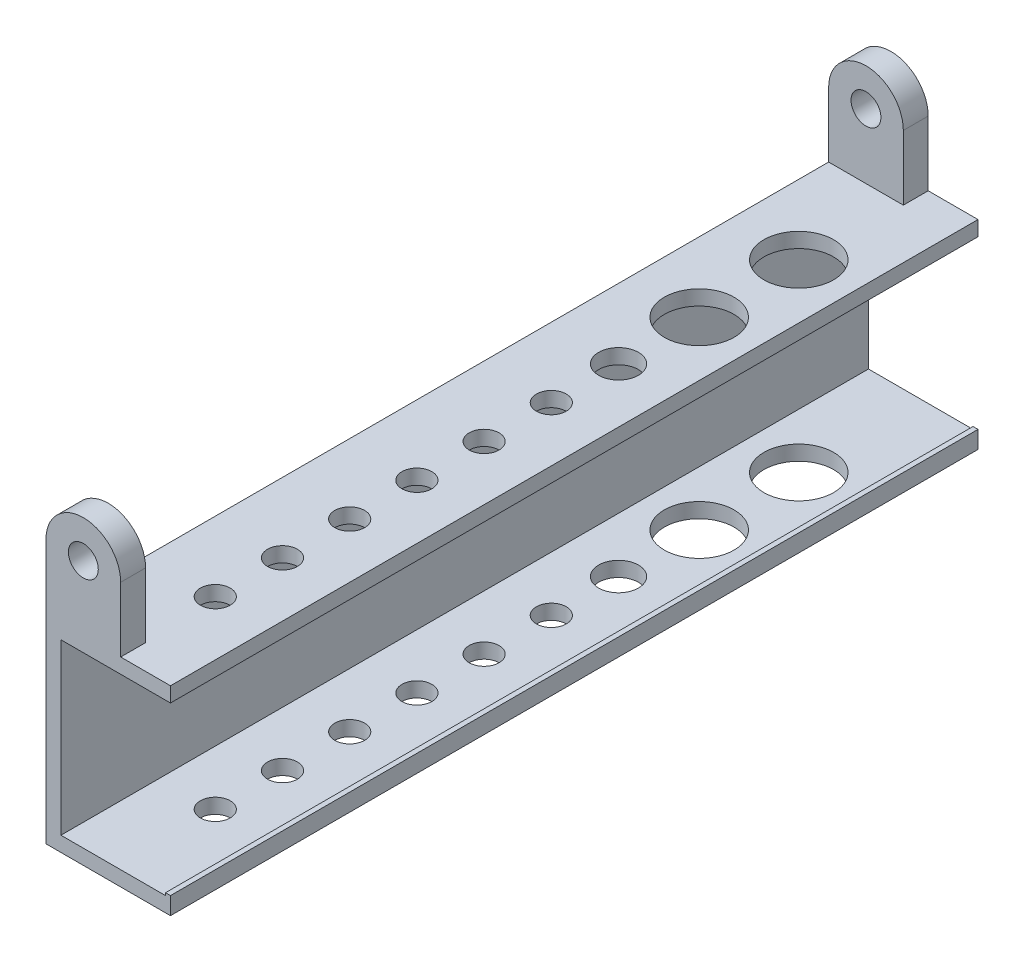
ISO-10303-21;
HEADER;
FILE_DESCRIPTION(('STEP AP214'),'2;1');
FILE_NAME('part.step','',(''),(''),'','','');
FILE_SCHEMA(('AUTOMOTIVE_DESIGN { 1 0 10303 214 1 1 1 1 }'));
ENDSEC;
DATA;
#1=APPLICATION_CONTEXT('core data for automotive mechanical design processes');
#2=APPLICATION_PROTOCOL_DEFINITION('international standard','automotive_design',2000,#1);
#3=PRODUCT_CONTEXT('',#1,'mechanical');
#4=PRODUCT('Part','Part','',(#3));
#5=PRODUCT_RELATED_PRODUCT_CATEGORY('part','',(#4));
#6=PRODUCT_DEFINITION_FORMATION('','',#4);
#7=PRODUCT_DEFINITION_CONTEXT('part definition',#1,'design');
#8=PRODUCT_DEFINITION('design','',#6,#7);
#9=PRODUCT_DEFINITION_SHAPE('','',#8);
#10=(LENGTH_UNIT() NAMED_UNIT(*) SI_UNIT(.MILLI.,.METRE.));
#11=(NAMED_UNIT(*) PLANE_ANGLE_UNIT() SI_UNIT($,.RADIAN.));
#12=(NAMED_UNIT(*) SI_UNIT($,.STERADIAN.) SOLID_ANGLE_UNIT());
#13=UNCERTAINTY_MEASURE_WITH_UNIT(LENGTH_MEASURE(1.E-05),#10,'distance_accuracy_value','');
#14=(GEOMETRIC_REPRESENTATION_CONTEXT(3) GLOBAL_UNCERTAINTY_ASSIGNED_CONTEXT((#13)) GLOBAL_UNIT_ASSIGNED_CONTEXT((#10,
#11,#12)) REPRESENTATION_CONTEXT('',''));
#15=CARTESIAN_POINT('',(0.,0.,0.));
#16=DIRECTION('',(0.,0.,1.));
#17=DIRECTION('',(1.,0.,0.));
#18=AXIS2_PLACEMENT_3D('',#15,#16,#17);
#19=CARTESIAN_POINT('',(25.,20.,162.2));
#20=DIRECTION('',(0.,-1.,0.));
#21=DIRECTION('',(1.,0.,0.));
#22=AXIS2_PLACEMENT_3D('',#19,#20,#21);
#23=PLANE('',#22);
#24=CARTESIAN_POINT('',(14.,20.,142.2));
#25=DIRECTION('',(0.,1.,0.));
#26=DIRECTION('',(-1.,0.,0.));
#27=AXIS2_PLACEMENT_3D('',#24,#25,#26);
#28=CIRCLE('',#27,3.);
#29=CARTESIAN_POINT('',(11.,20.,142.2));
#30=VERTEX_POINT('',#29);
#31=EDGE_CURVE('E716',#30,#30,#28,.T.);
#32=ORIENTED_EDGE('',*,*,#31,.F.);
#33=EDGE_LOOP('',(#32));
#34=FACE_BOUND('',#33,.T.);
#35=CARTESIAN_POINT('',(14.,20.,88.2));
#36=DIRECTION('',(0.,1.,0.));
#37=DIRECTION('',(-1.,0.,0.));
#38=AXIS2_PLACEMENT_3D('',#35,#36,#37);
#39=CIRCLE('',#38,3.);
#40=CARTESIAN_POINT('',(11.,20.,88.2));
#41=VERTEX_POINT('',#40);
#42=EDGE_CURVE('E803',#41,#41,#39,.T.);
#43=ORIENTED_EDGE('',*,*,#42,.F.);
#44=EDGE_LOOP('',(#43));
#45=FACE_BOUND('',#44,.T.);
#46=CARTESIAN_POINT('',(14.,20.,45.));
#47=DIRECTION('',(0.,1.,0.));
#48=DIRECTION('',(-1.,0.,0.));
#49=AXIS2_PLACEMENT_3D('',#46,#47,#48);
#50=CIRCLE('',#49,7.00000000000002);
#51=CARTESIAN_POINT('',(6.99999999999999,20.,45.));
#52=VERTEX_POINT('',#51);
#53=EDGE_CURVE('E796',#52,#52,#50,.T.);
#54=ORIENTED_EDGE('',*,*,#53,.F.);
#55=EDGE_LOOP('',(#54));
#56=FACE_BOUND('',#55,.T.);
#57=CARTESIAN_POINT('',(14.,20.,25.));
#58=DIRECTION('',(0.,1.,0.));
#59=DIRECTION('',(-1.,0.,0.));
#60=AXIS2_PLACEMENT_3D('',#57,#58,#59);
#61=CIRCLE('',#60,7.00000000000001);
#62=CARTESIAN_POINT('',(7.,20.,25.));
#63=VERTEX_POINT('',#62);
#64=EDGE_CURVE('E814',#63,#63,#61,.T.);
#65=ORIENTED_EDGE('',*,*,#64,.F.);
#66=EDGE_LOOP('',(#65));
#67=FACE_BOUND('',#66,.T.);
#68=CARTESIAN_POINT('',(14.,20.,61.2));
#69=DIRECTION('',(0.,1.,0.));
#70=DIRECTION('',(-1.,0.,0.));
#71=AXIS2_PLACEMENT_3D('',#68,#69,#70);
#72=CIRCLE('',#71,4.);
#73=CARTESIAN_POINT('',(10.,20.,61.2));
#74=VERTEX_POINT('',#73);
#75=EDGE_CURVE('E808',#74,#74,#72,.T.);
#76=ORIENTED_EDGE('',*,*,#75,.F.);
#77=EDGE_LOOP('',(#76));
#78=FACE_BOUND('',#77,.T.);
#79=CARTESIAN_POINT('',(14.,20.,74.7));
#80=DIRECTION('',(0.,1.,0.));
#81=DIRECTION('',(-1.,0.,0.));
#82=AXIS2_PLACEMENT_3D('',#79,#80,#81);
#83=CIRCLE('',#82,3.);
#84=CARTESIAN_POINT('',(11.,20.,74.7));
#85=VERTEX_POINT('',#84);
#86=EDGE_CURVE('E771',#85,#85,#83,.T.);
#87=ORIENTED_EDGE('',*,*,#86,.F.);
#88=EDGE_LOOP('',(#87));
#89=FACE_BOUND('',#88,.T.);
#90=CARTESIAN_POINT('',(14.,20.,101.7));
#91=DIRECTION('',(0.,1.,0.));
#92=DIRECTION('',(-1.,0.,0.));
#93=AXIS2_PLACEMENT_3D('',#90,#91,#92);
#94=CIRCLE('',#93,3.);
#95=CARTESIAN_POINT('',(11.,20.,101.7));
#96=VERTEX_POINT('',#95);
#97=EDGE_CURVE('E778',#96,#96,#94,.T.);
#98=ORIENTED_EDGE('',*,*,#97,.F.);
#99=EDGE_LOOP('',(#98));
#100=FACE_BOUND('',#99,.T.);
#101=CARTESIAN_POINT('',(14.,20.,115.2));
#102=DIRECTION('',(0.,1.,0.));
#103=DIRECTION('',(-1.,0.,0.));
#104=AXIS2_PLACEMENT_3D('',#101,#102,#103);
#105=CIRCLE('',#104,3.);
#106=CARTESIAN_POINT('',(11.,20.,115.2));
#107=VERTEX_POINT('',#106);
#108=EDGE_CURVE('E784',#107,#107,#105,.T.);
#109=ORIENTED_EDGE('',*,*,#108,.F.);
#110=EDGE_LOOP('',(#109));
#111=FACE_BOUND('',#110,.T.);
#112=CARTESIAN_POINT('',(14.,20.,128.7));
#113=DIRECTION('',(0.,1.,0.));
#114=DIRECTION('',(-1.,0.,0.));
#115=AXIS2_PLACEMENT_3D('',#112,#113,#114);
#116=CIRCLE('',#115,3.);
#117=CARTESIAN_POINT('',(11.,20.,128.7));
#118=VERTEX_POINT('',#117);
#119=EDGE_CURVE('E790',#118,#118,#116,.T.);
#120=ORIENTED_EDGE('',*,*,#119,.F.);
#121=EDGE_LOOP('',(#120));
#122=FACE_BOUND('',#121,.T.);
#123=DIRECTION('',(-1.,0.,0.));
#124=VECTOR('',#123,1.);
#125=CARTESIAN_POINT('',(25.,20.,0.));
#126=LINE('',#125,#124);
#127=CARTESIAN_POINT('',(25.,20.,0.));
#128=VERTEX_POINT('',#127);
#129=CARTESIAN_POINT('',(15.,20.,0.));
#130=VERTEX_POINT('',#129);
#131=EDGE_CURVE('E270',#128,#130,#126,.T.);
#132=ORIENTED_EDGE('',*,*,#131,.T.);
#133=DIRECTION('',(0.,0.,-1.));
#134=VECTOR('',#133,1.);
#135=CARTESIAN_POINT('',(15.,20.,5.));
#136=LINE('',#135,#134);
#137=CARTESIAN_POINT('',(15.,20.,5.));
#138=VERTEX_POINT('',#137);
#139=EDGE_CURVE('E57',#138,#130,#136,.T.);
#140=ORIENTED_EDGE('',*,*,#139,.F.);
#141=DIRECTION('',(1.,0.,0.));
#142=VECTOR('',#141,1.);
#143=CARTESIAN_POINT('',(0.,20.,5.));
#144=LINE('',#143,#142);
#145=CARTESIAN_POINT('',(0.,20.,5.));
#146=VERTEX_POINT('',#145);
#147=EDGE_CURVE('E199',#146,#138,#144,.T.);
#148=ORIENTED_EDGE('',*,*,#147,.F.);
#149=DIRECTION('',(0.,0.,-1.));
#150=VECTOR('',#149,1.);
#151=CARTESIAN_POINT('',(0.,20.,162.2));
#152=LINE('',#151,#150);
#153=CARTESIAN_POINT('',(0.,20.,157.2));
#154=VERTEX_POINT('',#153);
#155=EDGE_CURVE('E279',#154,#146,#152,.T.);
#156=ORIENTED_EDGE('',*,*,#155,.F.);
#157=DIRECTION('',(-1.,0.,0.));
#158=VECTOR('',#157,1.);
#159=CARTESIAN_POINT('',(0.,20.,157.2));
#160=LINE('',#159,#158);
#161=CARTESIAN_POINT('',(15.,20.,157.2));
#162=VERTEX_POINT('',#161);
#163=EDGE_CURVE('E226',#162,#154,#160,.T.);
#164=ORIENTED_EDGE('',*,*,#163,.F.);
#165=DIRECTION('',(0.,0.,1.));
#166=VECTOR('',#165,1.);
#167=CARTESIAN_POINT('',(15.,20.,157.2));
#168=LINE('',#167,#166);
#169=CARTESIAN_POINT('',(15.,20.,162.2));
#170=VERTEX_POINT('',#169);
#171=EDGE_CURVE('E239',#162,#170,#168,.T.);
#172=ORIENTED_EDGE('',*,*,#171,.T.);
#173=DIRECTION('',(-1.,0.,0.));
#174=VECTOR('',#173,1.);
#175=CARTESIAN_POINT('',(25.,20.,162.2));
#176=LINE('',#175,#174);
#177=CARTESIAN_POINT('',(25.,20.,162.2));
#178=VERTEX_POINT('',#177);
#179=EDGE_CURVE('E254',#178,#170,#176,.T.);
#180=ORIENTED_EDGE('',*,*,#179,.F.);
#181=DIRECTION('',(0.,0.,-1.));
#182=VECTOR('',#181,1.);
#183=CARTESIAN_POINT('',(25.,20.,162.2));
#184=LINE('',#183,#182);
#185=EDGE_CURVE('E282',#178,#128,#184,.T.);
#186=ORIENTED_EDGE('',*,*,#185,.T.);
#187=EDGE_LOOP('',(#132,#140,#148,#156,#164,#172,#180,#186));
#188=FACE_BOUND('',#187,.T.);
#189=ADVANCED_FACE('F34',(#34,#45,#56,#67,#78,#89,#100,#111,#122,#188),#23,.F.);
#190=CARTESIAN_POINT('',(25.,-17.,162.2));
#191=DIRECTION('',(0.,-1.,0.));
#192=DIRECTION('',(1.,0.,0.));
#193=AXIS2_PLACEMENT_3D('',#190,#191,#192);
#194=PLANE('',#193);
#195=CARTESIAN_POINT('',(14.,-17.,142.2));
#196=DIRECTION('',(0.,-1.,0.));
#197=DIRECTION('',(1.,0.,0.));
#198=AXIS2_PLACEMENT_3D('',#195,#196,#197);
#199=CIRCLE('',#198,3.);
#200=CARTESIAN_POINT('',(17.,-17.,142.2));
#201=VERTEX_POINT('',#200);
#202=EDGE_CURVE('E181',#201,#201,#199,.T.);
#203=ORIENTED_EDGE('',*,*,#202,.T.);
#204=EDGE_LOOP('',(#203));
#205=FACE_BOUND('',#204,.T.);
#206=CARTESIAN_POINT('',(14.,-17.,88.2));
#207=DIRECTION('',(0.,-1.,0.));
#208=DIRECTION('',(1.,0.,0.));
#209=AXIS2_PLACEMENT_3D('',#206,#207,#208);
#210=CIRCLE('',#209,3.);
#211=CARTESIAN_POINT('',(17.,-17.,88.2));
#212=VERTEX_POINT('',#211);
#213=EDGE_CURVE('E720',#212,#212,#210,.T.);
#214=ORIENTED_EDGE('',*,*,#213,.T.);
#215=EDGE_LOOP('',(#214));
#216=FACE_BOUND('',#215,.T.);
#217=CARTESIAN_POINT('',(14.,-17.,45.));
#218=DIRECTION('',(0.,-1.,0.));
#219=DIRECTION('',(1.,0.,0.));
#220=AXIS2_PLACEMENT_3D('',#217,#218,#219);
#221=CIRCLE('',#220,7.00000000000002);
#222=CARTESIAN_POINT('',(21.,-17.,45.));
#223=VERTEX_POINT('',#222);
#224=EDGE_CURVE('E728',#223,#223,#221,.T.);
#225=ORIENTED_EDGE('',*,*,#224,.T.);
#226=EDGE_LOOP('',(#225));
#227=FACE_BOUND('',#226,.T.);
#228=CARTESIAN_POINT('',(14.,-17.,25.));
#229=DIRECTION('',(0.,-1.,0.));
#230=DIRECTION('',(1.,0.,0.));
#231=AXIS2_PLACEMENT_3D('',#228,#229,#230);
#232=CIRCLE('',#231,7.00000000000001);
#233=CARTESIAN_POINT('',(21.,-17.,25.));
#234=VERTEX_POINT('',#233);
#235=EDGE_CURVE('E734',#234,#234,#232,.T.);
#236=ORIENTED_EDGE('',*,*,#235,.T.);
#237=EDGE_LOOP('',(#236));
#238=FACE_BOUND('',#237,.T.);
#239=CARTESIAN_POINT('',(14.,-17.,61.2));
#240=DIRECTION('',(0.,-1.,0.));
#241=DIRECTION('',(1.,0.,0.));
#242=AXIS2_PLACEMENT_3D('',#239,#240,#241);
#243=CIRCLE('',#242,4.);
#244=CARTESIAN_POINT('',(18.,-17.,61.2));
#245=VERTEX_POINT('',#244);
#246=EDGE_CURVE('E740',#245,#245,#243,.T.);
#247=ORIENTED_EDGE('',*,*,#246,.T.);
#248=EDGE_LOOP('',(#247));
#249=FACE_BOUND('',#248,.T.);
#250=CARTESIAN_POINT('',(14.,-17.,74.7));
#251=DIRECTION('',(0.,-1.,0.));
#252=DIRECTION('',(1.,0.,0.));
#253=AXIS2_PLACEMENT_3D('',#250,#251,#252);
#254=CIRCLE('',#253,3.);
#255=CARTESIAN_POINT('',(17.,-17.,74.7));
#256=VERTEX_POINT('',#255);
#257=EDGE_CURVE('E746',#256,#256,#254,.T.);
#258=ORIENTED_EDGE('',*,*,#257,.T.);
#259=EDGE_LOOP('',(#258));
#260=FACE_BOUND('',#259,.T.);
#261=CARTESIAN_POINT('',(14.,-17.,101.7));
#262=DIRECTION('',(0.,-1.,0.));
#263=DIRECTION('',(1.,0.,0.));
#264=AXIS2_PLACEMENT_3D('',#261,#262,#263);
#265=CIRCLE('',#264,3.);
#266=CARTESIAN_POINT('',(17.,-17.,101.7));
#267=VERTEX_POINT('',#266);
#268=EDGE_CURVE('E752',#267,#267,#265,.T.);
#269=ORIENTED_EDGE('',*,*,#268,.T.);
#270=EDGE_LOOP('',(#269));
#271=FACE_BOUND('',#270,.T.);
#272=CARTESIAN_POINT('',(14.,-17.,115.2));
#273=DIRECTION('',(0.,-1.,0.));
#274=DIRECTION('',(1.,0.,0.));
#275=AXIS2_PLACEMENT_3D('',#272,#273,#274);
#276=CIRCLE('',#275,3.);
#277=CARTESIAN_POINT('',(17.,-17.,115.2));
#278=VERTEX_POINT('',#277);
#279=EDGE_CURVE('E758',#278,#278,#276,.T.);
#280=ORIENTED_EDGE('',*,*,#279,.T.);
#281=EDGE_LOOP('',(#280));
#282=FACE_BOUND('',#281,.T.);
#283=CARTESIAN_POINT('',(14.,-17.,128.7));
#284=DIRECTION('',(0.,-1.,0.));
#285=DIRECTION('',(1.,0.,0.));
#286=AXIS2_PLACEMENT_3D('',#283,#284,#285);
#287=CIRCLE('',#286,3.);
#288=CARTESIAN_POINT('',(17.,-17.,128.7));
#289=VERTEX_POINT('',#288);
#290=EDGE_CURVE('E764',#289,#289,#287,.T.);
#291=ORIENTED_EDGE('',*,*,#290,.T.);
#292=EDGE_LOOP('',(#291));
#293=FACE_BOUND('',#292,.T.);
#294=DIRECTION('',(-1.,0.,0.));
#295=VECTOR('',#294,1.);
#296=CARTESIAN_POINT('',(25.,-17.,162.2));
#297=LINE('',#296,#295);
#298=CARTESIAN_POINT('',(24.,-17.,162.2));
#299=VERTEX_POINT('',#298);
#300=CARTESIAN_POINT('',(3.00000000000001,-17.,162.2));
#301=VERTEX_POINT('',#300);
#302=EDGE_CURVE('E49',#299,#301,#297,.T.);
#303=ORIENTED_EDGE('',*,*,#302,.F.);
#304=DIRECTION('',(0.,0.,1.));
#305=VECTOR('',#304,1.);
#306=CARTESIAN_POINT('',(24.,-17.,0.));
#307=LINE('',#306,#305);
#308=CARTESIAN_POINT('',(24.,-17.,0.));
#309=VERTEX_POINT('',#308);
#310=EDGE_CURVE('E185',#309,#299,#307,.T.);
#311=ORIENTED_EDGE('',*,*,#310,.F.);
#312=DIRECTION('',(-1.,0.,0.));
#313=VECTOR('',#312,1.);
#314=CARTESIAN_POINT('',(25.,-17.,0.));
#315=LINE('',#314,#313);
#316=CARTESIAN_POINT('',(3.00000000000001,-17.,0.));
#317=VERTEX_POINT('',#316);
#318=EDGE_CURVE('E242',#309,#317,#315,.T.);
#319=ORIENTED_EDGE('',*,*,#318,.T.);
#320=DIRECTION('',(0.,0.,-1.));
#321=VECTOR('',#320,1.);
#322=CARTESIAN_POINT('',(3.00000000000001,-17.,162.2));
#323=LINE('',#322,#321);
#324=EDGE_CURVE('E11',#301,#317,#323,.T.);
#325=ORIENTED_EDGE('',*,*,#324,.F.);
#326=EDGE_LOOP('',(#303,#311,#319,#325));
#327=FACE_BOUND('',#326,.T.);
#328=ADVANCED_FACE('F36',(#205,#216,#227,#238,#249,#260,#271,#282,#293,#327),#194,.F.);
#329=CARTESIAN_POINT('',(3.00000000000001,-17.,162.2));
#330=DIRECTION('',(-1.,0.,0.));
#331=DIRECTION('',(0.,-1.,0.));
#332=AXIS2_PLACEMENT_3D('',#329,#330,#331);
#333=PLANE('',#332);
#334=DIRECTION('',(0.,1.,0.));
#335=VECTOR('',#334,1.);
#336=CARTESIAN_POINT('',(3.00000000000001,-17.,0.));
#337=LINE('',#336,#335);
#338=CARTESIAN_POINT('',(3.,17.,0.));
#339=VERTEX_POINT('',#338);
#340=EDGE_CURVE('E264',#317,#339,#337,.T.);
#341=ORIENTED_EDGE('',*,*,#340,.T.);
#342=DIRECTION('',(0.,0.,-1.));
#343=VECTOR('',#342,1.);
#344=CARTESIAN_POINT('',(3.,17.,162.2));
#345=LINE('',#344,#343);
#346=CARTESIAN_POINT('',(3.,17.,162.2));
#347=VERTEX_POINT('',#346);
#348=EDGE_CURVE('E42',#347,#339,#345,.T.);
#349=ORIENTED_EDGE('',*,*,#348,.F.);
#350=DIRECTION('',(0.,1.,0.));
#351=VECTOR('',#350,1.);
#352=CARTESIAN_POINT('',(3.00000000000001,-17.,162.2));
#353=LINE('',#352,#351);
#354=EDGE_CURVE('E248',#301,#347,#353,.T.);
#355=ORIENTED_EDGE('',*,*,#354,.F.);
#356=ORIENTED_EDGE('',*,*,#324,.T.);
#357=EDGE_LOOP('',(#341,#349,#355,#356));
#358=FACE_BOUND('',#357,.T.);
#359=ADVANCED_FACE('F309',(#358),#333,.F.);
#360=CARTESIAN_POINT('',(3.,17.,162.2));
#361=DIRECTION('',(0.,1.,0.));
#362=DIRECTION('',(0.,0.,1.));
#363=AXIS2_PLACEMENT_3D('',#360,#361,#362);
#364=PLANE('',#363);
#365=CARTESIAN_POINT('',(14.,17.,142.2));
#366=DIRECTION('',(0.,1.,0.));
#367=DIRECTION('',(0.,0.,1.));
#368=AXIS2_PLACEMENT_3D('',#365,#366,#367);
#369=CIRCLE('',#368,3.);
#370=CARTESIAN_POINT('',(14.,17.,145.2));
#371=VERTEX_POINT('',#370);
#372=EDGE_CURVE('E719',#371,#371,#369,.T.);
#373=ORIENTED_EDGE('',*,*,#372,.T.);
#374=EDGE_LOOP('',(#373));
#375=FACE_BOUND('',#374,.T.);
#376=CARTESIAN_POINT('',(14.,17.,88.2));
#377=DIRECTION('',(0.,1.,0.));
#378=DIRECTION('',(0.,0.,1.));
#379=AXIS2_PLACEMENT_3D('',#376,#377,#378);
#380=CIRCLE('',#379,3.);
#381=CARTESIAN_POINT('',(14.,17.,91.2));
#382=VERTEX_POINT('',#381);
#383=EDGE_CURVE('E723',#382,#382,#380,.T.);
#384=ORIENTED_EDGE('',*,*,#383,.T.);
#385=EDGE_LOOP('',(#384));
#386=FACE_BOUND('',#385,.T.);
#387=CARTESIAN_POINT('',(14.,17.,45.));
#388=DIRECTION('',(0.,1.,0.));
#389=DIRECTION('',(0.,0.,1.));
#390=AXIS2_PLACEMENT_3D('',#387,#388,#389);
#391=CIRCLE('',#390,7.00000000000002);
#392=CARTESIAN_POINT('',(14.,17.,52.));
#393=VERTEX_POINT('',#392);
#394=EDGE_CURVE('E731',#393,#393,#391,.T.);
#395=ORIENTED_EDGE('',*,*,#394,.T.);
#396=EDGE_LOOP('',(#395));
#397=FACE_BOUND('',#396,.T.);
#398=CARTESIAN_POINT('',(14.,17.,25.));
#399=DIRECTION('',(0.,1.,0.));
#400=DIRECTION('',(0.,0.,1.));
#401=AXIS2_PLACEMENT_3D('',#398,#399,#400);
#402=CIRCLE('',#401,7.00000000000001);
#403=CARTESIAN_POINT('',(14.,17.,32.));
#404=VERTEX_POINT('',#403);
#405=EDGE_CURVE('E737',#404,#404,#402,.T.);
#406=ORIENTED_EDGE('',*,*,#405,.T.);
#407=EDGE_LOOP('',(#406));
#408=FACE_BOUND('',#407,.T.);
#409=CARTESIAN_POINT('',(14.,17.,61.2));
#410=DIRECTION('',(0.,1.,0.));
#411=DIRECTION('',(0.,0.,1.));
#412=AXIS2_PLACEMENT_3D('',#409,#410,#411);
#413=CIRCLE('',#412,4.);
#414=CARTESIAN_POINT('',(14.,17.,65.2));
#415=VERTEX_POINT('',#414);
#416=EDGE_CURVE('E743',#415,#415,#413,.T.);
#417=ORIENTED_EDGE('',*,*,#416,.T.);
#418=EDGE_LOOP('',(#417));
#419=FACE_BOUND('',#418,.T.);
#420=CARTESIAN_POINT('',(14.,17.,74.7));
#421=DIRECTION('',(0.,1.,0.));
#422=DIRECTION('',(0.,0.,1.));
#423=AXIS2_PLACEMENT_3D('',#420,#421,#422);
#424=CIRCLE('',#423,3.);
#425=CARTESIAN_POINT('',(14.,17.,77.7));
#426=VERTEX_POINT('',#425);
#427=EDGE_CURVE('E749',#426,#426,#424,.T.);
#428=ORIENTED_EDGE('',*,*,#427,.T.);
#429=EDGE_LOOP('',(#428));
#430=FACE_BOUND('',#429,.T.);
#431=CARTESIAN_POINT('',(14.,17.,101.7));
#432=DIRECTION('',(0.,1.,0.));
#433=DIRECTION('',(0.,0.,1.));
#434=AXIS2_PLACEMENT_3D('',#431,#432,#433);
#435=CIRCLE('',#434,3.);
#436=CARTESIAN_POINT('',(14.,17.,104.7));
#437=VERTEX_POINT('',#436);
#438=EDGE_CURVE('E755',#437,#437,#435,.T.);
#439=ORIENTED_EDGE('',*,*,#438,.T.);
#440=EDGE_LOOP('',(#439));
#441=FACE_BOUND('',#440,.T.);
#442=CARTESIAN_POINT('',(14.,17.,115.2));
#443=DIRECTION('',(0.,1.,0.));
#444=DIRECTION('',(0.,0.,1.));
#445=AXIS2_PLACEMENT_3D('',#442,#443,#444);
#446=CIRCLE('',#445,3.);
#447=CARTESIAN_POINT('',(14.,17.,118.2));
#448=VERTEX_POINT('',#447);
#449=EDGE_CURVE('E761',#448,#448,#446,.T.);
#450=ORIENTED_EDGE('',*,*,#449,.T.);
#451=EDGE_LOOP('',(#450));
#452=FACE_BOUND('',#451,.T.);
#453=CARTESIAN_POINT('',(14.,17.,128.7));
#454=DIRECTION('',(0.,1.,0.));
#455=DIRECTION('',(0.,0.,1.));
#456=AXIS2_PLACEMENT_3D('',#453,#454,#455);
#457=CIRCLE('',#456,3.);
#458=CARTESIAN_POINT('',(14.,17.,131.7));
#459=VERTEX_POINT('',#458);
#460=EDGE_CURVE('E767',#459,#459,#457,.T.);
#461=ORIENTED_EDGE('',*,*,#460,.T.);
#462=EDGE_LOOP('',(#461));
#463=FACE_BOUND('',#462,.T.);
#464=DIRECTION('',(1.,0.,0.));
#465=VECTOR('',#464,1.);
#466=CARTESIAN_POINT('',(3.,17.,0.));
#467=LINE('',#466,#465);
#468=CARTESIAN_POINT('',(25.,17.,0.));
#469=VERTEX_POINT('',#468);
#470=EDGE_CURVE('E266',#339,#469,#467,.T.);
#471=ORIENTED_EDGE('',*,*,#470,.T.);
#472=DIRECTION('',(0.,0.,-1.));
#473=VECTOR('',#472,1.);
#474=CARTESIAN_POINT('',(25.,17.,162.2));
#475=LINE('',#474,#473);
#476=CARTESIAN_POINT('',(25.,17.,162.2));
#477=VERTEX_POINT('',#476);
#478=EDGE_CURVE('E285',#477,#469,#475,.T.);
#479=ORIENTED_EDGE('',*,*,#478,.F.);
#480=DIRECTION('',(1.,0.,0.));
#481=VECTOR('',#480,1.);
#482=CARTESIAN_POINT('',(3.,17.,162.2));
#483=LINE('',#482,#481);
#484=EDGE_CURVE('E250',#347,#477,#483,.T.);
#485=ORIENTED_EDGE('',*,*,#484,.F.);
#486=ORIENTED_EDGE('',*,*,#348,.T.);
#487=EDGE_LOOP('',(#471,#479,#485,#486));
#488=FACE_BOUND('',#487,.T.);
#489=ADVANCED_FACE('F292',(#375,#386,#397,#408,#419,#430,#441,#452,#463,#488),#364,.F.);
#490=CARTESIAN_POINT('',(25.,17.,162.2));
#491=DIRECTION('',(-1.,0.,0.));
#492=DIRECTION('',(0.,0.,1.));
#493=AXIS2_PLACEMENT_3D('',#490,#491,#492);
#494=PLANE('',#493);
#495=DIRECTION('',(0.,1.,0.));
#496=VECTOR('',#495,1.);
#497=CARTESIAN_POINT('',(25.,17.,0.));
#498=LINE('',#497,#496);
#499=EDGE_CURVE('E268',#469,#128,#498,.T.);
#500=ORIENTED_EDGE('',*,*,#499,.T.);
#501=ORIENTED_EDGE('',*,*,#185,.F.);
#502=DIRECTION('',(0.,1.,0.));
#503=VECTOR('',#502,1.);
#504=CARTESIAN_POINT('',(25.,17.,162.2));
#505=LINE('',#504,#503);
#506=EDGE_CURVE('E252',#477,#178,#505,.T.);
#507=ORIENTED_EDGE('',*,*,#506,.F.);
#508=ORIENTED_EDGE('',*,*,#478,.T.);
#509=EDGE_LOOP('',(#500,#501,#507,#508));
#510=FACE_BOUND('',#509,.T.);
#511=ADVANCED_FACE('F301',(#510),#494,.F.);
#512=CARTESIAN_POINT('',(0.,20.,162.2));
#513=DIRECTION('',(1.,0.,0.));
#514=DIRECTION('',(0.,1.,0.));
#515=AXIS2_PLACEMENT_3D('',#512,#513,#514);
#516=PLANE('',#515);
#517=DIRECTION('',(0.,-1.,0.));
#518=VECTOR('',#517,1.);
#519=CARTESIAN_POINT('',(0.,20.,0.));
#520=LINE('',#519,#518);
#521=CARTESIAN_POINT('',(0.,33.,0.));
#522=VERTEX_POINT('',#521);
#523=CARTESIAN_POINT('',(0.,-20.,0.));
#524=VERTEX_POINT('',#523);
#525=EDGE_CURVE('E272',#522,#524,#520,.T.);
#526=ORIENTED_EDGE('',*,*,#525,.T.);
#527=DIRECTION('',(0.,0.,-1.));
#528=VECTOR('',#527,1.);
#529=CARTESIAN_POINT('',(0.,-20.,162.2));
#530=LINE('',#529,#528);
#531=CARTESIAN_POINT('',(0.,-20.,162.2));
#532=VERTEX_POINT('',#531);
#533=EDGE_CURVE('E276',#532,#524,#530,.T.);
#534=ORIENTED_EDGE('',*,*,#533,.F.);
#535=DIRECTION('',(0.,-1.,0.));
#536=VECTOR('',#535,1.);
#537=CARTESIAN_POINT('',(0.,20.,162.2));
#538=LINE('',#537,#536);
#539=CARTESIAN_POINT('',(0.,33.,162.2));
#540=VERTEX_POINT('',#539);
#541=EDGE_CURVE('E257',#540,#532,#538,.T.);
#542=ORIENTED_EDGE('',*,*,#541,.F.);
#543=DIRECTION('',(0.,0.,1.));
#544=VECTOR('',#543,1.);
#545=CARTESIAN_POINT('',(0.,33.,157.2));
#546=LINE('',#545,#544);
#547=CARTESIAN_POINT('',(0.,33.,157.2));
#548=VERTEX_POINT('',#547);
#549=EDGE_CURVE('E243',#548,#540,#546,.T.);
#550=ORIENTED_EDGE('',*,*,#549,.F.);
#551=DIRECTION('',(0.,1.,0.));
#552=VECTOR('',#551,1.);
#553=CARTESIAN_POINT('',(0.,0.,157.2));
#554=LINE('',#553,#552);
#555=EDGE_CURVE('E224',#154,#548,#554,.T.);
#556=ORIENTED_EDGE('',*,*,#555,.F.);
#557=ORIENTED_EDGE('',*,*,#155,.T.);
#558=DIRECTION('',(0.,-1.,0.));
#559=VECTOR('',#558,1.);
#560=CARTESIAN_POINT('',(0.,0.,5.));
#561=LINE('',#560,#559);
#562=CARTESIAN_POINT('',(0.,33.,5.));
#563=VERTEX_POINT('',#562);
#564=EDGE_CURVE('E201',#563,#146,#561,.T.);
#565=ORIENTED_EDGE('',*,*,#564,.F.);
#566=DIRECTION('',(0.,0.,-1.));
#567=VECTOR('',#566,1.);
#568=CARTESIAN_POINT('',(0.,33.,5.));
#569=LINE('',#568,#567);
#570=EDGE_CURVE('E212',#563,#522,#569,.T.);
#571=ORIENTED_EDGE('',*,*,#570,.T.);
#572=EDGE_LOOP('',(#526,#534,#542,#550,#556,#557,#565,#571));
#573=FACE_BOUND('',#572,.T.);
#574=ADVANCED_FACE('F321',(#573),#516,.F.);
#575=CARTESIAN_POINT('',(0.,-20.,162.2));
#576=DIRECTION('',(0.,1.,0.));
#577=DIRECTION('',(0.,0.,1.));
#578=AXIS2_PLACEMENT_3D('',#575,#576,#577);
#579=PLANE('',#578);
#580=CARTESIAN_POINT('',(14.,-20.,142.2));
#581=DIRECTION('',(0.,1.,0.));
#582=DIRECTION('',(-1.,0.,0.));
#583=AXIS2_PLACEMENT_3D('',#580,#581,#582);
#584=CIRCLE('',#583,3.);
#585=CARTESIAN_POINT('',(11.,-20.,142.2));
#586=VERTEX_POINT('',#585);
#587=EDGE_CURVE('E770',#586,#586,#584,.T.);
#588=ORIENTED_EDGE('',*,*,#587,.T.);
#589=EDGE_LOOP('',(#588));
#590=FACE_BOUND('',#589,.T.);
#591=CARTESIAN_POINT('',(14.,-20.,88.2));
#592=DIRECTION('',(0.,1.,0.));
#593=DIRECTION('',(-1.,0.,0.));
#594=AXIS2_PLACEMENT_3D('',#591,#592,#593);
#595=CIRCLE('',#594,3.);
#596=CARTESIAN_POINT('',(11.,-20.,88.2));
#597=VERTEX_POINT('',#596);
#598=EDGE_CURVE('E775',#597,#597,#595,.T.);
#599=ORIENTED_EDGE('',*,*,#598,.T.);
#600=EDGE_LOOP('',(#599));
#601=FACE_BOUND('',#600,.T.);
#602=CARTESIAN_POINT('',(14.,-20.,45.));
#603=DIRECTION('',(0.,1.,0.));
#604=DIRECTION('',(-1.,0.,0.));
#605=AXIS2_PLACEMENT_3D('',#602,#603,#604);
#606=CIRCLE('',#605,7.00000000000002);
#607=CARTESIAN_POINT('',(7.,-20.,45.));
#608=VERTEX_POINT('',#607);
#609=EDGE_CURVE('E799',#608,#608,#606,.T.);
#610=ORIENTED_EDGE('',*,*,#609,.T.);
#611=EDGE_LOOP('',(#610));
#612=FACE_BOUND('',#611,.T.);
#613=CARTESIAN_POINT('',(14.,-20.,25.));
#614=DIRECTION('',(0.,1.,0.));
#615=DIRECTION('',(-1.,0.,0.));
#616=AXIS2_PLACEMENT_3D('',#613,#614,#615);
#617=CIRCLE('',#616,7.00000000000001);
#618=CARTESIAN_POINT('',(7.,-20.,25.));
#619=VERTEX_POINT('',#618);
#620=EDGE_CURVE('E800',#619,#619,#617,.T.);
#621=ORIENTED_EDGE('',*,*,#620,.T.);
#622=EDGE_LOOP('',(#621));
#623=FACE_BOUND('',#622,.T.);
#624=CARTESIAN_POINT('',(14.,-20.,61.2));
#625=DIRECTION('',(0.,1.,0.));
#626=DIRECTION('',(-1.,0.,0.));
#627=AXIS2_PLACEMENT_3D('',#624,#625,#626);
#628=CIRCLE('',#627,4.);
#629=CARTESIAN_POINT('',(10.,-20.,61.2));
#630=VERTEX_POINT('',#629);
#631=EDGE_CURVE('E811',#630,#630,#628,.T.);
#632=ORIENTED_EDGE('',*,*,#631,.T.);
#633=EDGE_LOOP('',(#632));
#634=FACE_BOUND('',#633,.T.);
#635=CARTESIAN_POINT('',(14.,-20.,74.7));
#636=DIRECTION('',(0.,1.,0.));
#637=DIRECTION('',(-1.,0.,0.));
#638=AXIS2_PLACEMENT_3D('',#635,#636,#637);
#639=CIRCLE('',#638,3.);
#640=CARTESIAN_POINT('',(11.,-20.,74.7));
#641=VERTEX_POINT('',#640);
#642=EDGE_CURVE('E774',#641,#641,#639,.T.);
#643=ORIENTED_EDGE('',*,*,#642,.T.);
#644=EDGE_LOOP('',(#643));
#645=FACE_BOUND('',#644,.T.);
#646=CARTESIAN_POINT('',(14.,-20.,101.7));
#647=DIRECTION('',(0.,1.,0.));
#648=DIRECTION('',(-1.,0.,0.));
#649=AXIS2_PLACEMENT_3D('',#646,#647,#648);
#650=CIRCLE('',#649,3.);
#651=CARTESIAN_POINT('',(11.,-20.,101.7));
#652=VERTEX_POINT('',#651);
#653=EDGE_CURVE('E781',#652,#652,#650,.T.);
#654=ORIENTED_EDGE('',*,*,#653,.T.);
#655=EDGE_LOOP('',(#654));
#656=FACE_BOUND('',#655,.T.);
#657=CARTESIAN_POINT('',(14.,-20.,115.2));
#658=DIRECTION('',(0.,1.,0.));
#659=DIRECTION('',(-1.,0.,0.));
#660=AXIS2_PLACEMENT_3D('',#657,#658,#659);
#661=CIRCLE('',#660,3.);
#662=CARTESIAN_POINT('',(11.,-20.,115.2));
#663=VERTEX_POINT('',#662);
#664=EDGE_CURVE('E787',#663,#663,#661,.T.);
#665=ORIENTED_EDGE('',*,*,#664,.T.);
#666=EDGE_LOOP('',(#665));
#667=FACE_BOUND('',#666,.T.);
#668=CARTESIAN_POINT('',(14.,-20.,128.7));
#669=DIRECTION('',(0.,1.,0.));
#670=DIRECTION('',(-1.,0.,0.));
#671=AXIS2_PLACEMENT_3D('',#668,#669,#670);
#672=CIRCLE('',#671,3.);
#673=CARTESIAN_POINT('',(11.,-20.,128.7));
#674=VERTEX_POINT('',#673);
#675=EDGE_CURVE('E793',#674,#674,#672,.T.);
#676=ORIENTED_EDGE('',*,*,#675,.T.);
#677=EDGE_LOOP('',(#676));
#678=FACE_BOUND('',#677,.T.);
#679=DIRECTION('',(1.,0.,0.));
#680=VECTOR('',#679,1.);
#681=CARTESIAN_POINT('',(0.,-20.,0.));
#682=LINE('',#681,#680);
#683=CARTESIAN_POINT('',(25.,-20.,0.));
#684=VERTEX_POINT('',#683);
#685=EDGE_CURVE('E160',#524,#684,#682,.T.);
#686=ORIENTED_EDGE('',*,*,#685,.T.);
#687=DIRECTION('',(0.,0.,-1.));
#688=VECTOR('',#687,1.);
#689=CARTESIAN_POINT('',(25.,-20.,162.2));
#690=LINE('',#689,#688);
#691=CARTESIAN_POINT('',(25.,-20.,162.2));
#692=VERTEX_POINT('',#691);
#693=EDGE_CURVE('E156',#692,#684,#690,.T.);
#694=ORIENTED_EDGE('',*,*,#693,.F.);
#695=DIRECTION('',(1.,0.,0.));
#696=VECTOR('',#695,1.);
#697=CARTESIAN_POINT('',(0.,-20.,162.2));
#698=LINE('',#697,#696);
#699=EDGE_CURVE('E259',#532,#692,#698,.T.);
#700=ORIENTED_EDGE('',*,*,#699,.F.);
#701=ORIENTED_EDGE('',*,*,#533,.T.);
#702=EDGE_LOOP('',(#686,#694,#700,#701));
#703=FACE_BOUND('',#702,.T.);
#704=ADVANCED_FACE('F316',(#590,#601,#612,#623,#634,#645,#656,#667,#678,#703),#579,.F.);
#705=CARTESIAN_POINT('',(25.,-20.,162.2));
#706=DIRECTION('',(-1.,0.,0.));
#707=DIRECTION('',(0.,0.,1.));
#708=AXIS2_PLACEMENT_3D('',#705,#706,#707);
#709=PLANE('',#708);
#710=DIRECTION('',(0.,1.,0.));
#711=VECTOR('',#710,1.);
#712=CARTESIAN_POINT('',(25.,-20.,0.));
#713=LINE('',#712,#711);
#714=CARTESIAN_POINT('',(25.,-16.5,0.));
#715=VERTEX_POINT('',#714);
#716=EDGE_CURVE('E149',#684,#715,#713,.T.);
#717=ORIENTED_EDGE('',*,*,#716,.T.);
#718=DIRECTION('',(0.,0.,1.));
#719=VECTOR('',#718,1.);
#720=CARTESIAN_POINT('',(25.,-16.5,0.));
#721=LINE('',#720,#719);
#722=CARTESIAN_POINT('',(25.,-16.5,162.2));
#723=VERTEX_POINT('',#722);
#724=EDGE_CURVE('E153',#715,#723,#721,.T.);
#725=ORIENTED_EDGE('',*,*,#724,.T.);
#726=DIRECTION('',(0.,1.,0.));
#727=VECTOR('',#726,1.);
#728=CARTESIAN_POINT('',(25.,-20.,162.2));
#729=LINE('',#728,#727);
#730=EDGE_CURVE('E261',#692,#723,#729,.T.);
#731=ORIENTED_EDGE('',*,*,#730,.F.);
#732=ORIENTED_EDGE('',*,*,#693,.T.);
#733=EDGE_LOOP('',(#717,#725,#731,#732));
#734=FACE_BOUND('',#733,.T.);
#735=ADVANCED_FACE('F151',(#734),#709,.F.);
#736=CARTESIAN_POINT('',(0.,0.,162.2));
#737=DIRECTION('',(0.,0.,-1.));
#738=DIRECTION('',(-1.,0.,0.));
#739=AXIS2_PLACEMENT_3D('',#736,#737,#738);
#740=PLANE('',#739);
#741=ORIENTED_EDGE('',*,*,#730,.T.);
#742=DIRECTION('',(-1.,0.,0.));
#743=VECTOR('',#742,1.);
#744=CARTESIAN_POINT('',(25.,-16.5,162.2));
#745=LINE('',#744,#743);
#746=CARTESIAN_POINT('',(24.,-16.5,162.2));
#747=VERTEX_POINT('',#746);
#748=EDGE_CURVE('E167',#723,#747,#745,.T.);
#749=ORIENTED_EDGE('',*,*,#748,.T.);
#750=DIRECTION('',(0.,-1.,0.));
#751=VECTOR('',#750,1.);
#752=CARTESIAN_POINT('',(24.,-17.,162.2));
#753=LINE('',#752,#751);
#754=EDGE_CURVE('E175',#747,#299,#753,.T.);
#755=ORIENTED_EDGE('',*,*,#754,.T.);
#756=ORIENTED_EDGE('',*,*,#302,.T.);
#757=ORIENTED_EDGE('',*,*,#354,.T.);
#758=ORIENTED_EDGE('',*,*,#484,.T.);
#759=ORIENTED_EDGE('',*,*,#506,.T.);
#760=ORIENTED_EDGE('',*,*,#179,.T.);
#761=DIRECTION('',(0.,1.,0.));
#762=VECTOR('',#761,1.);
#763=CARTESIAN_POINT('',(15.,0.,162.2));
#764=LINE('',#763,#762);
#765=CARTESIAN_POINT('',(15.,33.,162.2));
#766=VERTEX_POINT('',#765);
#767=EDGE_CURVE('E215',#170,#766,#764,.T.);
#768=ORIENTED_EDGE('',*,*,#767,.T.);
#769=CARTESIAN_POINT('',(7.5,33.,162.2));
#770=DIRECTION('',(0.,0.,1.));
#771=DIRECTION('',(1.,0.,0.));
#772=AXIS2_PLACEMENT_3D('',#769,#770,#771);
#773=CIRCLE('',#772,7.5);
#774=EDGE_CURVE('E234',#540,#766,#773,.F.);
#775=ORIENTED_EDGE('',*,*,#774,.F.);
#776=ORIENTED_EDGE('',*,*,#541,.T.);
#777=ORIENTED_EDGE('',*,*,#699,.T.);
#778=EDGE_LOOP('',(#741,#749,#755,#756,#757,#758,#759,#760,#768,#775,#776,#777));
#779=FACE_BOUND('',#778,.T.);
#780=CARTESIAN_POINT('',(7.5,33.,162.2));
#781=DIRECTION('',(0.,0.,1.));
#782=DIRECTION('',(1.,0.,0.));
#783=AXIS2_PLACEMENT_3D('',#780,#781,#782);
#784=CIRCLE('',#783,3.);
#785=CARTESIAN_POINT('',(10.5,33.,162.2));
#786=VERTEX_POINT('',#785);
#787=EDGE_CURVE('E222',#786,#786,#784,.T.);
#788=ORIENTED_EDGE('',*,*,#787,.F.);
#789=EDGE_LOOP('',(#788));
#790=FACE_BOUND('',#789,.T.);
#791=ADVANCED_FACE('F306',(#779,#790),#740,.F.);
#792=CARTESIAN_POINT('',(0.,0.,0.));
#793=DIRECTION('',(0.,0.,-1.));
#794=DIRECTION('',(-1.,0.,0.));
#795=AXIS2_PLACEMENT_3D('',#792,#793,#794);
#796=PLANE('',#795);
#797=ORIENTED_EDGE('',*,*,#318,.F.);
#798=DIRECTION('',(0.,-1.,0.));
#799=VECTOR('',#798,1.);
#800=CARTESIAN_POINT('',(24.,-17.,0.));
#801=LINE('',#800,#799);
#802=CARTESIAN_POINT('',(24.,-16.5,0.));
#803=VERTEX_POINT('',#802);
#804=EDGE_CURVE('E169',#803,#309,#801,.T.);
#805=ORIENTED_EDGE('',*,*,#804,.F.);
#806=DIRECTION('',(-1.,0.,0.));
#807=VECTOR('',#806,1.);
#808=CARTESIAN_POINT('',(25.,-16.5,0.));
#809=LINE('',#808,#807);
#810=EDGE_CURVE('E165',#715,#803,#809,.T.);
#811=ORIENTED_EDGE('',*,*,#810,.F.);
#812=ORIENTED_EDGE('',*,*,#716,.F.);
#813=ORIENTED_EDGE('',*,*,#685,.F.);
#814=ORIENTED_EDGE('',*,*,#525,.F.);
#815=CARTESIAN_POINT('',(7.5,33.,0.));
#816=DIRECTION('',(0.,0.,-1.));
#817=DIRECTION('',(-1.,0.,0.));
#818=AXIS2_PLACEMENT_3D('',#815,#816,#817);
#819=CIRCLE('',#818,7.5);
#820=CARTESIAN_POINT('',(15.,33.,0.));
#821=VERTEX_POINT('',#820);
#822=EDGE_CURVE('E207',#821,#522,#819,.F.);
#823=ORIENTED_EDGE('',*,*,#822,.F.);
#824=DIRECTION('',(0.,-1.,0.));
#825=VECTOR('',#824,1.);
#826=CARTESIAN_POINT('',(15.,0.,0.));
#827=LINE('',#826,#825);
#828=EDGE_CURVE('E193',#821,#130,#827,.T.);
#829=ORIENTED_EDGE('',*,*,#828,.T.);
#830=ORIENTED_EDGE('',*,*,#131,.F.);
#831=ORIENTED_EDGE('',*,*,#499,.F.);
#832=ORIENTED_EDGE('',*,*,#470,.F.);
#833=ORIENTED_EDGE('',*,*,#340,.F.);
#834=EDGE_LOOP('',(#797,#805,#811,#812,#813,#814,#823,#829,#830,#831,#832,#833));
#835=FACE_BOUND('',#834,.T.);
#836=CARTESIAN_POINT('',(7.5,33.,0.));
#837=DIRECTION('',(0.,0.,-1.));
#838=DIRECTION('',(-1.,0.,0.));
#839=AXIS2_PLACEMENT_3D('',#836,#837,#838);
#840=CIRCLE('',#839,3.);
#841=CARTESIAN_POINT('',(4.5,33.,0.));
#842=VERTEX_POINT('',#841);
#843=EDGE_CURVE('E187',#842,#842,#840,.T.);
#844=ORIENTED_EDGE('',*,*,#843,.F.);
#845=EDGE_LOOP('',(#844));
#846=FACE_BOUND('',#845,.T.);
#847=ADVANCED_FACE('F172',(#835,#846),#796,.T.);
#848=CARTESIAN_POINT('',(15.,0.,157.2));
#849=DIRECTION('',(1.,0.,0.));
#850=DIRECTION('',(0.,1.,0.));
#851=AXIS2_PLACEMENT_3D('',#848,#849,#850);
#852=PLANE('',#851);
#853=ORIENTED_EDGE('',*,*,#767,.F.);
#854=ORIENTED_EDGE('',*,*,#171,.F.);
#855=DIRECTION('',(0.,1.,0.));
#856=VECTOR('',#855,1.);
#857=CARTESIAN_POINT('',(15.,0.,157.2));
#858=LINE('',#857,#856);
#859=CARTESIAN_POINT('',(15.,33.,157.2));
#860=VERTEX_POINT('',#859);
#861=EDGE_CURVE('E218',#162,#860,#858,.T.);
#862=ORIENTED_EDGE('',*,*,#861,.T.);
#863=DIRECTION('',(0.,0.,1.));
#864=VECTOR('',#863,1.);
#865=CARTESIAN_POINT('',(15.,33.,157.2));
#866=LINE('',#865,#864);
#867=EDGE_CURVE('E231',#860,#766,#866,.T.);
#868=ORIENTED_EDGE('',*,*,#867,.T.);
#869=EDGE_LOOP('',(#853,#854,#862,#868));
#870=FACE_BOUND('',#869,.T.);
#871=ADVANCED_FACE('F340',(#870),#852,.T.);
#872=CARTESIAN_POINT('',(7.5,33.,157.2));
#873=DIRECTION('',(0.,0.,1.));
#874=DIRECTION('',(1.,0.,0.));
#875=AXIS2_PLACEMENT_3D('',#872,#873,#874);
#876=CYLINDRICAL_SURFACE('',#875,7.5);
#877=ORIENTED_EDGE('',*,*,#774,.T.);
#878=ORIENTED_EDGE('',*,*,#867,.F.);
#879=CARTESIAN_POINT('',(7.5,33.,157.2));
#880=DIRECTION('',(0.,0.,1.));
#881=DIRECTION('',(1.,0.,0.));
#882=AXIS2_PLACEMENT_3D('',#879,#880,#881);
#883=CIRCLE('',#882,7.5);
#884=EDGE_CURVE('E221',#548,#860,#883,.F.);
#885=ORIENTED_EDGE('',*,*,#884,.F.);
#886=ORIENTED_EDGE('',*,*,#549,.T.);
#887=EDGE_LOOP('',(#877,#878,#885,#886));
#888=FACE_BOUND('',#887,.T.);
#889=ADVANCED_FACE('F342',(#888),#876,.T.);
#890=CARTESIAN_POINT('',(7.5,33.,157.2));
#891=DIRECTION('',(0.,0.,1.));
#892=DIRECTION('',(1.,0.,0.));
#893=AXIS2_PLACEMENT_3D('',#890,#891,#892);
#894=CYLINDRICAL_SURFACE('',#893,3.);
#895=CARTESIAN_POINT('',(7.5,33.,157.2));
#896=DIRECTION('',(0.,0.,1.));
#897=DIRECTION('',(1.,0.,0.));
#898=AXIS2_PLACEMENT_3D('',#895,#896,#897);
#899=CIRCLE('',#898,3.);
#900=CARTESIAN_POINT('',(10.5,33.,157.2));
#901=VERTEX_POINT('',#900);
#902=EDGE_CURVE('E228',#901,#901,#899,.T.);
#903=ORIENTED_EDGE('',*,*,#902,.F.);
#904=EDGE_LOOP('',(#903));
#905=FACE_BOUND('',#904,.T.);
#906=ORIENTED_EDGE('',*,*,#787,.T.);
#907=EDGE_LOOP('',(#906));
#908=FACE_BOUND('',#907,.T.);
#909=ADVANCED_FACE('F344',(#905,#908),#894,.F.);
#910=CARTESIAN_POINT('',(0.,0.,157.2));
#911=DIRECTION('',(0.,0.,1.));
#912=DIRECTION('',(1.,0.,0.));
#913=AXIS2_PLACEMENT_3D('',#910,#911,#912);
#914=PLANE('',#913);
#915=ORIENTED_EDGE('',*,*,#861,.F.);
#916=ORIENTED_EDGE('',*,*,#163,.T.);
#917=ORIENTED_EDGE('',*,*,#555,.T.);
#918=ORIENTED_EDGE('',*,*,#884,.T.);
#919=EDGE_LOOP('',(#915,#916,#917,#918));
#920=FACE_BOUND('',#919,.T.);
#921=ORIENTED_EDGE('',*,*,#902,.T.);
#922=EDGE_LOOP('',(#921));
#923=FACE_BOUND('',#922,.T.);
#924=ADVANCED_FACE('F336',(#920,#923),#914,.F.);
#925=CARTESIAN_POINT('',(7.5,33.,5.));
#926=DIRECTION('',(0.,0.,-1.));
#927=DIRECTION('',(-1.,0.,0.));
#928=AXIS2_PLACEMENT_3D('',#925,#926,#927);
#929=CYLINDRICAL_SURFACE('',#928,7.5);
#930=ORIENTED_EDGE('',*,*,#822,.T.);
#931=ORIENTED_EDGE('',*,*,#570,.F.);
#932=CARTESIAN_POINT('',(7.5,33.,5.));
#933=DIRECTION('',(0.,0.,-1.));
#934=DIRECTION('',(-1.,0.,0.));
#935=AXIS2_PLACEMENT_3D('',#932,#933,#934);
#936=CIRCLE('',#935,7.5);
#937=CARTESIAN_POINT('',(15.,33.,5.));
#938=VERTEX_POINT('',#937);
#939=EDGE_CURVE('E192',#938,#563,#936,.F.);
#940=ORIENTED_EDGE('',*,*,#939,.F.);
#941=DIRECTION('',(0.,0.,-1.));
#942=VECTOR('',#941,1.);
#943=CARTESIAN_POINT('',(15.,33.,5.));
#944=LINE('',#943,#942);
#945=EDGE_CURVE('E204',#938,#821,#944,.T.);
#946=ORIENTED_EDGE('',*,*,#945,.T.);
#947=EDGE_LOOP('',(#930,#931,#940,#946));
#948=FACE_BOUND('',#947,.T.);
#949=ADVANCED_FACE('F324',(#948),#929,.T.);
#950=CARTESIAN_POINT('',(7.5,33.,5.));
#951=DIRECTION('',(0.,0.,-1.));
#952=DIRECTION('',(-1.,0.,0.));
#953=AXIS2_PLACEMENT_3D('',#950,#951,#952);
#954=CYLINDRICAL_SURFACE('',#953,3.);
#955=CARTESIAN_POINT('',(7.5,33.,5.));
#956=DIRECTION('',(0.,0.,-1.));
#957=DIRECTION('',(-1.,0.,0.));
#958=AXIS2_PLACEMENT_3D('',#955,#956,#957);
#959=CIRCLE('',#958,3.);
#960=CARTESIAN_POINT('',(4.5,33.,5.));
#961=VERTEX_POINT('',#960);
#962=EDGE_CURVE('E189',#961,#961,#959,.T.);
#963=ORIENTED_EDGE('',*,*,#962,.F.);
#964=EDGE_LOOP('',(#963));
#965=FACE_BOUND('',#964,.T.);
#966=ORIENTED_EDGE('',*,*,#843,.T.);
#967=EDGE_LOOP('',(#966));
#968=FACE_BOUND('',#967,.T.);
#969=ADVANCED_FACE('F446',(#965,#968),#954,.F.);
#970=CARTESIAN_POINT('',(15.,0.,5.));
#971=DIRECTION('',(1.,0.,0.));
#972=DIRECTION('',(0.,0.,-1.));
#973=AXIS2_PLACEMENT_3D('',#970,#971,#972);
#974=PLANE('',#973);
#975=ORIENTED_EDGE('',*,*,#828,.F.);
#976=ORIENTED_EDGE('',*,*,#945,.F.);
#977=DIRECTION('',(0.,-1.,0.));
#978=VECTOR('',#977,1.);
#979=CARTESIAN_POINT('',(15.,0.,5.));
#980=LINE('',#979,#978);
#981=EDGE_CURVE('E196',#938,#138,#980,.T.);
#982=ORIENTED_EDGE('',*,*,#981,.T.);
#983=ORIENTED_EDGE('',*,*,#139,.T.);
#984=EDGE_LOOP('',(#975,#976,#982,#983));
#985=FACE_BOUND('',#984,.T.);
#986=ADVANCED_FACE('F327',(#985),#974,.T.);
#987=CARTESIAN_POINT('',(0.,0.,5.));
#988=DIRECTION('',(0.,0.,-1.));
#989=DIRECTION('',(-1.,0.,0.));
#990=AXIS2_PLACEMENT_3D('',#987,#988,#989);
#991=PLANE('',#990);
#992=ORIENTED_EDGE('',*,*,#962,.T.);
#993=EDGE_LOOP('',(#992));
#994=FACE_BOUND('',#993,.T.);
#995=ORIENTED_EDGE('',*,*,#939,.T.);
#996=ORIENTED_EDGE('',*,*,#564,.T.);
#997=ORIENTED_EDGE('',*,*,#147,.T.);
#998=ORIENTED_EDGE('',*,*,#981,.F.);
#999=EDGE_LOOP('',(#995,#996,#997,#998));
#1000=FACE_BOUND('',#999,.T.);
#1001=ADVANCED_FACE('F329',(#994,#1000),#991,.F.);
#1002=CARTESIAN_POINT('',(24.,-17.,0.));
#1003=DIRECTION('',(-1.,0.,0.));
#1004=DIRECTION('',(0.,0.,1.));
#1005=AXIS2_PLACEMENT_3D('',#1002,#1003,#1004);
#1006=PLANE('',#1005);
#1007=ORIENTED_EDGE('',*,*,#754,.F.);
#1008=DIRECTION('',(0.,0.,1.));
#1009=VECTOR('',#1008,1.);
#1010=CARTESIAN_POINT('',(24.,-16.5,0.));
#1011=LINE('',#1010,#1009);
#1012=EDGE_CURVE('E168',#803,#747,#1011,.T.);
#1013=ORIENTED_EDGE('',*,*,#1012,.F.);
#1014=ORIENTED_EDGE('',*,*,#804,.T.);
#1015=ORIENTED_EDGE('',*,*,#310,.T.);
#1016=EDGE_LOOP('',(#1007,#1013,#1014,#1015));
#1017=FACE_BOUND('',#1016,.T.);
#1018=ADVANCED_FACE('F312',(#1017),#1006,.T.);
#1019=CARTESIAN_POINT('',(25.,-16.5,0.));
#1020=DIRECTION('',(0.,1.,0.));
#1021=DIRECTION('',(0.,0.,1.));
#1022=AXIS2_PLACEMENT_3D('',#1019,#1020,#1021);
#1023=PLANE('',#1022);
#1024=ORIENTED_EDGE('',*,*,#748,.F.);
#1025=ORIENTED_EDGE('',*,*,#724,.F.);
#1026=ORIENTED_EDGE('',*,*,#810,.T.);
#1027=ORIENTED_EDGE('',*,*,#1012,.T.);
#1028=EDGE_LOOP('',(#1024,#1025,#1026,#1027));
#1029=FACE_BOUND('',#1028,.T.);
#1030=ADVANCED_FACE('F164',(#1029),#1023,.T.);
#1031=CARTESIAN_POINT('',(14.,-20.,128.7));
#1032=DIRECTION('',(0.,1.,0.));
#1033=DIRECTION('',(-1.,0.,0.));
#1034=AXIS2_PLACEMENT_3D('',#1031,#1032,#1033);
#1035=CYLINDRICAL_SURFACE('',#1034,3.);
#1036=ORIENTED_EDGE('',*,*,#675,.F.);
#1037=EDGE_LOOP('',(#1036));
#1038=FACE_BOUND('',#1037,.T.);
#1039=ORIENTED_EDGE('',*,*,#290,.F.);
#1040=EDGE_LOOP('',(#1039));
#1041=FACE_BOUND('',#1040,.T.);
#1042=ADVANCED_FACE('F477',(#1038,#1041),#1035,.F.);
#1043=CARTESIAN_POINT('',(14.,-20.,115.2));
#1044=DIRECTION('',(0.,1.,0.));
#1045=DIRECTION('',(-1.,0.,0.));
#1046=AXIS2_PLACEMENT_3D('',#1043,#1044,#1045);
#1047=CYLINDRICAL_SURFACE('',#1046,3.);
#1048=ORIENTED_EDGE('',*,*,#664,.F.);
#1049=EDGE_LOOP('',(#1048));
#1050=FACE_BOUND('',#1049,.T.);
#1051=ORIENTED_EDGE('',*,*,#279,.F.);
#1052=EDGE_LOOP('',(#1051));
#1053=FACE_BOUND('',#1052,.T.);
#1054=ADVANCED_FACE('F483',(#1050,#1053),#1047,.F.);
#1055=CARTESIAN_POINT('',(14.,-20.,101.7));
#1056=DIRECTION('',(0.,1.,0.));
#1057=DIRECTION('',(-1.,0.,0.));
#1058=AXIS2_PLACEMENT_3D('',#1055,#1056,#1057);
#1059=CYLINDRICAL_SURFACE('',#1058,3.);
#1060=ORIENTED_EDGE('',*,*,#653,.F.);
#1061=EDGE_LOOP('',(#1060));
#1062=FACE_BOUND('',#1061,.T.);
#1063=ORIENTED_EDGE('',*,*,#268,.F.);
#1064=EDGE_LOOP('',(#1063));
#1065=FACE_BOUND('',#1064,.T.);
#1066=ADVANCED_FACE('F492',(#1062,#1065),#1059,.F.);
#1067=CARTESIAN_POINT('',(14.,-20.,74.7));
#1068=DIRECTION('',(0.,1.,0.));
#1069=DIRECTION('',(-1.,0.,0.));
#1070=AXIS2_PLACEMENT_3D('',#1067,#1068,#1069);
#1071=CYLINDRICAL_SURFACE('',#1070,3.);
#1072=ORIENTED_EDGE('',*,*,#642,.F.);
#1073=EDGE_LOOP('',(#1072));
#1074=FACE_BOUND('',#1073,.T.);
#1075=ORIENTED_EDGE('',*,*,#257,.F.);
#1076=EDGE_LOOP('',(#1075));
#1077=FACE_BOUND('',#1076,.T.);
#1078=ADVANCED_FACE('F501',(#1074,#1077),#1071,.F.);
#1079=CARTESIAN_POINT('',(14.,-20.,61.2));
#1080=DIRECTION('',(0.,1.,0.));
#1081=DIRECTION('',(-1.,0.,0.));
#1082=AXIS2_PLACEMENT_3D('',#1079,#1080,#1081);
#1083=CYLINDRICAL_SURFACE('',#1082,4.);
#1084=ORIENTED_EDGE('',*,*,#631,.F.);
#1085=EDGE_LOOP('',(#1084));
#1086=FACE_BOUND('',#1085,.T.);
#1087=ORIENTED_EDGE('',*,*,#246,.F.);
#1088=EDGE_LOOP('',(#1087));
#1089=FACE_BOUND('',#1088,.T.);
#1090=ADVANCED_FACE('F510',(#1086,#1089),#1083,.F.);
#1091=CARTESIAN_POINT('',(14.,-20.,25.));
#1092=DIRECTION('',(0.,1.,0.));
#1093=DIRECTION('',(-1.,0.,0.));
#1094=AXIS2_PLACEMENT_3D('',#1091,#1092,#1093);
#1095=CYLINDRICAL_SURFACE('',#1094,7.00000000000001);
#1096=ORIENTED_EDGE('',*,*,#620,.F.);
#1097=EDGE_LOOP('',(#1096));
#1098=FACE_BOUND('',#1097,.T.);
#1099=ORIENTED_EDGE('',*,*,#235,.F.);
#1100=EDGE_LOOP('',(#1099));
#1101=FACE_BOUND('',#1100,.T.);
#1102=ADVANCED_FACE('F519',(#1098,#1101),#1095,.F.);
#1103=CARTESIAN_POINT('',(14.,-20.,45.));
#1104=DIRECTION('',(0.,1.,0.));
#1105=DIRECTION('',(-1.,0.,0.));
#1106=AXIS2_PLACEMENT_3D('',#1103,#1104,#1105);
#1107=CYLINDRICAL_SURFACE('',#1106,7.00000000000002);
#1108=ORIENTED_EDGE('',*,*,#609,.F.);
#1109=EDGE_LOOP('',(#1108));
#1110=FACE_BOUND('',#1109,.T.);
#1111=ORIENTED_EDGE('',*,*,#224,.F.);
#1112=EDGE_LOOP('',(#1111));
#1113=FACE_BOUND('',#1112,.T.);
#1114=ADVANCED_FACE('F528',(#1110,#1113),#1107,.F.);
#1115=CARTESIAN_POINT('',(14.,-20.,88.2));
#1116=DIRECTION('',(0.,1.,0.));
#1117=DIRECTION('',(-1.,0.,0.));
#1118=AXIS2_PLACEMENT_3D('',#1115,#1116,#1117);
#1119=CYLINDRICAL_SURFACE('',#1118,3.);
#1120=ORIENTED_EDGE('',*,*,#598,.F.);
#1121=EDGE_LOOP('',(#1120));
#1122=FACE_BOUND('',#1121,.T.);
#1123=ORIENTED_EDGE('',*,*,#213,.F.);
#1124=EDGE_LOOP('',(#1123));
#1125=FACE_BOUND('',#1124,.T.);
#1126=ADVANCED_FACE('F537',(#1122,#1125),#1119,.F.);
#1127=CARTESIAN_POINT('',(14.,-20.,142.2));
#1128=DIRECTION('',(0.,1.,0.));
#1129=DIRECTION('',(-1.,0.,0.));
#1130=AXIS2_PLACEMENT_3D('',#1127,#1128,#1129);
#1131=CYLINDRICAL_SURFACE('',#1130,3.);
#1132=ORIENTED_EDGE('',*,*,#587,.F.);
#1133=EDGE_LOOP('',(#1132));
#1134=FACE_BOUND('',#1133,.T.);
#1135=ORIENTED_EDGE('',*,*,#202,.F.);
#1136=EDGE_LOOP('',(#1135));
#1137=FACE_BOUND('',#1136,.T.);
#1138=ADVANCED_FACE('F546',(#1134,#1137),#1131,.F.);
#1139=ORIENTED_EDGE('',*,*,#119,.T.);
#1140=EDGE_LOOP('',(#1139));
#1141=FACE_BOUND('',#1140,.T.);
#1142=ORIENTED_EDGE('',*,*,#460,.F.);
#1143=EDGE_LOOP('',(#1142));
#1144=FACE_BOUND('',#1143,.T.);
#1145=ADVANCED_FACE('F486',(#1141,#1144),#1035,.F.);
#1146=ORIENTED_EDGE('',*,*,#108,.T.);
#1147=EDGE_LOOP('',(#1146));
#1148=FACE_BOUND('',#1147,.T.);
#1149=ORIENTED_EDGE('',*,*,#449,.F.);
#1150=EDGE_LOOP('',(#1149));
#1151=FACE_BOUND('',#1150,.T.);
#1152=ADVANCED_FACE('F495',(#1148,#1151),#1047,.F.);
#1153=ORIENTED_EDGE('',*,*,#97,.T.);
#1154=EDGE_LOOP('',(#1153));
#1155=FACE_BOUND('',#1154,.T.);
#1156=ORIENTED_EDGE('',*,*,#438,.F.);
#1157=EDGE_LOOP('',(#1156));
#1158=FACE_BOUND('',#1157,.T.);
#1159=ADVANCED_FACE('F504',(#1155,#1158),#1059,.F.);
#1160=ORIENTED_EDGE('',*,*,#86,.T.);
#1161=EDGE_LOOP('',(#1160));
#1162=FACE_BOUND('',#1161,.T.);
#1163=ORIENTED_EDGE('',*,*,#427,.F.);
#1164=EDGE_LOOP('',(#1163));
#1165=FACE_BOUND('',#1164,.T.);
#1166=ADVANCED_FACE('F513',(#1162,#1165),#1071,.F.);
#1167=ORIENTED_EDGE('',*,*,#75,.T.);
#1168=EDGE_LOOP('',(#1167));
#1169=FACE_BOUND('',#1168,.T.);
#1170=ORIENTED_EDGE('',*,*,#416,.F.);
#1171=EDGE_LOOP('',(#1170));
#1172=FACE_BOUND('',#1171,.T.);
#1173=ADVANCED_FACE('F522',(#1169,#1172),#1083,.F.);
#1174=ORIENTED_EDGE('',*,*,#64,.T.);
#1175=EDGE_LOOP('',(#1174));
#1176=FACE_BOUND('',#1175,.T.);
#1177=ORIENTED_EDGE('',*,*,#405,.F.);
#1178=EDGE_LOOP('',(#1177));
#1179=FACE_BOUND('',#1178,.T.);
#1180=ADVANCED_FACE('F531',(#1176,#1179),#1095,.F.);
#1181=ORIENTED_EDGE('',*,*,#53,.T.);
#1182=EDGE_LOOP('',(#1181));
#1183=FACE_BOUND('',#1182,.T.);
#1184=ORIENTED_EDGE('',*,*,#394,.F.);
#1185=EDGE_LOOP('',(#1184));
#1186=FACE_BOUND('',#1185,.T.);
#1187=ADVANCED_FACE('F540',(#1183,#1186),#1107,.F.);
#1188=ORIENTED_EDGE('',*,*,#42,.T.);
#1189=EDGE_LOOP('',(#1188));
#1190=FACE_BOUND('',#1189,.T.);
#1191=ORIENTED_EDGE('',*,*,#383,.F.);
#1192=EDGE_LOOP('',(#1191));
#1193=FACE_BOUND('',#1192,.T.);
#1194=ADVANCED_FACE('F549',(#1190,#1193),#1119,.F.);
#1195=ORIENTED_EDGE('',*,*,#31,.T.);
#1196=EDGE_LOOP('',(#1195));
#1197=FACE_BOUND('',#1196,.T.);
#1198=ORIENTED_EDGE('',*,*,#372,.F.);
#1199=EDGE_LOOP('',(#1198));
#1200=FACE_BOUND('',#1199,.T.);
#1201=ADVANCED_FACE('F557',(#1197,#1200),#1131,.F.);
#1202=CLOSED_SHELL('',(#189,#328,#359,#489,#511,#574,#704,#735,#791,#847,#871,#889,#909,#924,
#949,#969,#986,#1001,#1018,#1030,#1042,#1054,#1066,#1078,#1090,#1102,#1114,#1126,#1138,#1145,
#1152,#1159,#1166,#1173,#1180,#1187,#1194,#1201));
#1203=MANIFOLD_SOLID_BREP('B2',#1202);
#1204=ADVANCED_BREP_SHAPE_REPRESENTATION('',(#18,#1203),#14);
#1205=SHAPE_DEFINITION_REPRESENTATION(#9,#1204);
ENDSEC;
END-ISO-10303-21;
